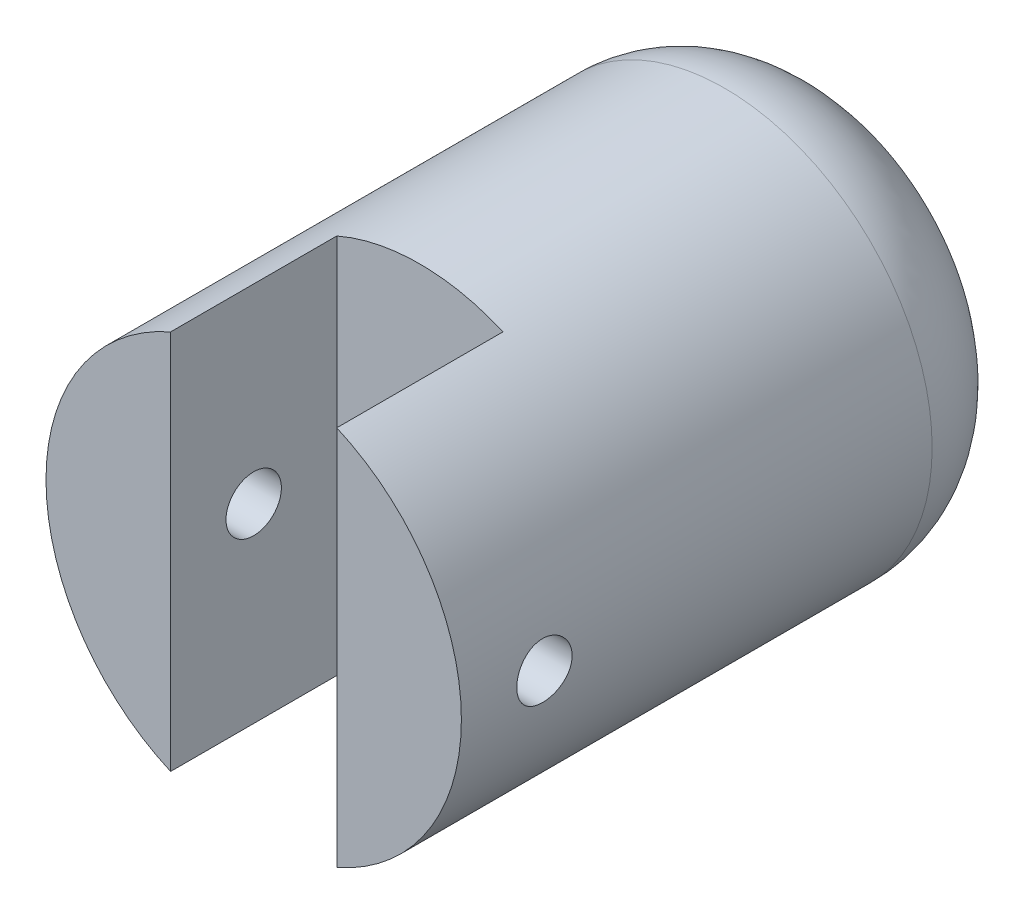
ISO-10303-21;
HEADER;
FILE_DESCRIPTION(('STEP AP214'),'2;1');
FILE_NAME('part.step','',(''),(''),'','','');
FILE_SCHEMA(('AUTOMOTIVE_DESIGN { 1 0 10303 214 1 1 1 1 }'));
ENDSEC;
DATA;
#1=APPLICATION_CONTEXT('core data for automotive mechanical design processes');
#2=APPLICATION_PROTOCOL_DEFINITION('international standard','automotive_design',2000,#1);
#3=PRODUCT_CONTEXT('',#1,'mechanical');
#4=PRODUCT('Part','Part','',(#3));
#5=PRODUCT_RELATED_PRODUCT_CATEGORY('part','',(#4));
#6=PRODUCT_DEFINITION_FORMATION('','',#4);
#7=PRODUCT_DEFINITION_CONTEXT('part definition',#1,'design');
#8=PRODUCT_DEFINITION('design','',#6,#7);
#9=PRODUCT_DEFINITION_SHAPE('','',#8);
#10=(LENGTH_UNIT() NAMED_UNIT(*) SI_UNIT(.MILLI.,.METRE.));
#11=(NAMED_UNIT(*) PLANE_ANGLE_UNIT() SI_UNIT($,.RADIAN.));
#12=(NAMED_UNIT(*) SI_UNIT($,.STERADIAN.) SOLID_ANGLE_UNIT());
#13=UNCERTAINTY_MEASURE_WITH_UNIT(LENGTH_MEASURE(1.E-05),#10,'distance_accuracy_value','');
#14=(GEOMETRIC_REPRESENTATION_CONTEXT(3) GLOBAL_UNCERTAINTY_ASSIGNED_CONTEXT((#13)) GLOBAL_UNIT_ASSIGNED_CONTEXT((#10,
#11,#12)) REPRESENTATION_CONTEXT('',''));
#15=CARTESIAN_POINT('',(0.,0.,0.));
#16=DIRECTION('',(0.,0.,1.));
#17=DIRECTION('',(1.,0.,0.));
#18=AXIS2_PLACEMENT_3D('',#15,#16,#17);
#19=CARTESIAN_POINT('',(0.,0.,21.));
#20=DIRECTION('',(0.,0.,1.));
#21=DIRECTION('',(1.,0.,0.));
#22=AXIS2_PLACEMENT_3D('',#19,#20,#21);
#23=PLANE('',#22);
#24=DIRECTION('',(0.,1.,0.));
#25=VECTOR('',#24,1.);
#26=CARTESIAN_POINT('',(3.,-9.,21.));
#27=LINE('',#26,#25);
#28=CARTESIAN_POINT('',(3.,-6.87386354243376,21.));
#29=VERTEX_POINT('',#28);
#30=CARTESIAN_POINT('',(3.,6.87386354243376,21.));
#31=VERTEX_POINT('',#30);
#32=EDGE_CURVE('E85',#29,#31,#27,.T.);
#33=ORIENTED_EDGE('',*,*,#32,.F.);
#34=CARTESIAN_POINT('',(0.,0.,21.));
#35=DIRECTION('',(0.,0.,1.));
#36=DIRECTION('',(1.,0.,0.));
#37=AXIS2_PLACEMENT_3D('',#34,#35,#36);
#38=CIRCLE('',#37,7.5);
#39=EDGE_CURVE('E98',#29,#31,#38,.T.);
#40=ORIENTED_EDGE('',*,*,#39,.T.);
#41=EDGE_LOOP('',(#33,#40));
#42=FACE_BOUND('',#41,.T.);
#43=ADVANCED_FACE('F36',(#42),#23,.T.);
#44=CARTESIAN_POINT('',(-10.5,0.,18.));
#45=DIRECTION('',(1.,0.,0.));
#46=DIRECTION('',(0.,0.,-1.));
#47=AXIS2_PLACEMENT_3D('',#44,#45,#46);
#48=CYLINDRICAL_SURFACE('',#47,1.);
#49=CARTESIAN_POINT('',(3.,0.,18.));
#50=DIRECTION('',(1.,0.,0.));
#51=DIRECTION('',(0.,0.,-1.));
#52=AXIS2_PLACEMENT_3D('',#49,#50,#51);
#53=CIRCLE('',#52,1.);
#54=CARTESIAN_POINT('',(3.,0.,17.));
#55=VERTEX_POINT('',#54);
#56=EDGE_CURVE('E145',#55,#55,#53,.F.);
#57=ORIENTED_EDGE('',*,*,#56,.T.);
#58=EDGE_LOOP('',(#57));
#59=FACE_BOUND('',#58,.T.);
#60=CARTESIAN_POINT('',(7.5,0.,17.));
#61=CARTESIAN_POINT('',(7.49999917871272,-0.0559044178346422,17.0000023548535));
#62=CARTESIAN_POINT('',(7.49936835363597,-0.11184298963814,17.0047037689812));
#63=CARTESIAN_POINT('',(7.49691255563452,-0.22216136256904,17.0233831745248));
#64=CARTESIAN_POINT('',(7.49508636220862,-0.276539511166519,17.0373706474486));
#65=CARTESIAN_POINT('',(7.49044539924533,-0.382124156313491,17.0742008587707));
#66=CARTESIAN_POINT('',(7.48763132105486,-0.433332841529245,17.0970374055192));
#67=CARTESIAN_POINT('',(7.48132693330196,-0.531181947515148,17.1509034569031));
#68=CARTESIAN_POINT('',(7.47783673279283,-0.577823103168513,17.1819316405832));
#69=CARTESIAN_POINT('',(7.47054497394982,-0.66551291125234,17.2515066308021));
#70=CARTESIAN_POINT('',(7.46674179081055,-0.706528992747931,17.2900943225042));
#71=CARTESIAN_POINT('',(7.45926568778975,-0.781523678365508,17.3736050945383));
#72=CARTESIAN_POINT('',(7.45559277481171,-0.815501909986107,17.4185285099979));
#73=CARTESIAN_POINT('',(7.44877717720095,-0.875579511344539,17.5136495614725));
#74=CARTESIAN_POINT('',(7.44563658882881,-0.901648037412891,17.5638668412393));
#75=CARTESIAN_POINT('',(7.44026293689616,-0.944969225036452,17.6680155336184));
#76=CARTESIAN_POINT('',(7.43802983425604,-0.962222266226391,17.7219467861767));
#77=CARTESIAN_POINT('',(7.43473968284334,-0.987323033860871,17.8316529052508));
#78=CARTESIAN_POINT('',(7.43367572685068,-0.995226021142534,17.8874149172665));
#79=CARTESIAN_POINT('',(7.43282325804657,-1.00157340274059,17.999483089803));
#80=CARTESIAN_POINT('',(7.433034687102,-1.00001822816801,18.0557892254055));
#81=CARTESIAN_POINT('',(7.43470277886495,-0.987538729696174,18.166960565014));
#82=CARTESIAN_POINT('',(7.43615132311171,-0.97667548765881,18.2218327649429));
#83=CARTESIAN_POINT('',(7.44011776387373,-0.945983623171859,18.3289684183801));
#84=CARTESIAN_POINT('',(7.44263568477064,-0.926154796307288,18.3812318123775));
#85=CARTESIAN_POINT('',(7.44846630555513,-0.878029645715957,18.4818548173536));
#86=CARTESIAN_POINT('',(7.45178147061949,-0.849706989568747,18.5302016855972));
#87=CARTESIAN_POINT('',(7.45883118109967,-0.785416966721448,18.6214795409588));
#88=CARTESIAN_POINT('',(7.46256574831765,-0.749449202511926,18.6644102462771));
#89=CARTESIAN_POINT('',(7.47006949616793,-0.670552450131814,18.743991506291));
#90=CARTESIAN_POINT('',(7.47383871770599,-0.627570853513225,18.7805899213512));
#91=CARTESIAN_POINT('',(7.48095961909132,-0.536047085066706,18.8460610224642));
#92=CARTESIAN_POINT('',(7.48431129773577,-0.487504897221186,18.8749336862618));
#93=CARTESIAN_POINT('',(7.49022196871789,-0.386196109865235,18.9241345588474));
#94=CARTESIAN_POINT('',(7.49278063604478,-0.333427789420616,18.9444592655232));
#95=CARTESIAN_POINT('',(7.49681412952036,-0.225185462168125,18.9759446594862));
#96=CARTESIAN_POINT('',(7.49828901344964,-0.169711599771129,18.9871058353197));
#97=CARTESIAN_POINT('',(7.49998120688428,-0.0580834516628229,18.9998792163856));
#98=CARTESIAN_POINT('',(7.50020796924523,-0.00193751727352205,19.0015632008917));
#99=CARTESIAN_POINT('',(7.49940395769259,0.109835808609358,18.9955241679364));
#100=CARTESIAN_POINT('',(7.49837321434299,0.165463212672832,18.9878013791088));
#101=CARTESIAN_POINT('',(7.4951758767905,0.27440685778647,18.963227673308));
#102=CARTESIAN_POINT('',(7.49301357151461,0.327731008256023,18.9464112158389));
#103=CARTESIAN_POINT('',(7.48779504627144,0.430802549396781,18.9041635170315));
#104=CARTESIAN_POINT('',(7.4847387921972,0.48054980350782,18.8787319469934));
#105=CARTESIAN_POINT('',(7.47804918685037,0.57537443930804,18.8198039222084));
#106=CARTESIAN_POINT('',(7.47441257522858,0.620422907198304,18.7862613171433));
#107=CARTESIAN_POINT('',(7.46697864354991,0.70427647349595,18.7121283353879));
#108=CARTESIAN_POINT('',(7.4631813162031,0.743081288311894,18.6715376387418));
#109=CARTESIAN_POINT('',(7.45582451236755,0.813602747115492,18.5841434286802));
#110=CARTESIAN_POINT('',(7.45226674387649,0.845271638044693,18.5373012166309));
#111=CARTESIAN_POINT('',(7.44582066500909,0.900291755394072,18.4389202948595));
#112=CARTESIAN_POINT('',(7.44293233968392,0.923643167551734,18.3873816900448));
#113=CARTESIAN_POINT('',(7.43816405890039,0.961289182503732,18.2812213789862));
#114=CARTESIAN_POINT('',(7.43628117116299,0.975610144233979,18.2266091573946));
#115=CARTESIAN_POINT('',(7.43372874349146,0.994873335719795,18.1157281839356));
#116=CARTESIAN_POINT('',(7.43305913865671,0.99981606713391,18.0594595208378));
#117=CARTESIAN_POINT('',(7.43301115647724,1.00017242903095,17.9473382545732));
#118=CARTESIAN_POINT('',(7.4336226114126,0.995661095972465,17.8914858795179));
#119=CARTESIAN_POINT('',(7.43604591937099,0.977396883433447,17.7813410624481));
#120=CARTESIAN_POINT('',(7.43785777194415,0.963644007416344,17.727048619849));
#121=CARTESIAN_POINT('',(7.44247445136382,0.927311551661038,17.6215781583742));
#122=CARTESIAN_POINT('',(7.445278813297,0.904736104095208,17.5703986944416));
#123=CARTESIAN_POINT('',(7.45156522856411,0.851406713798688,17.472542058087));
#124=CARTESIAN_POINT('',(7.45504729498301,0.820652613152145,17.425864972622));
#125=CARTESIAN_POINT('',(7.46232983591531,0.751562242547543,17.3379551750358));
#126=CARTESIAN_POINT('',(7.46613252877041,0.713170136134506,17.2967665261224));
#127=CARTESIAN_POINT('',(7.47360859500832,0.63001084674912,17.2213883918192));
#128=CARTESIAN_POINT('',(7.47728193784489,0.58524217036489,17.1872005506249));
#129=CARTESIAN_POINT('',(7.48410317568764,0.490376493926413,17.1266664307667));
#130=CARTESIAN_POINT('',(7.48724873213445,0.440257310371984,17.1003546667224));
#131=CARTESIAN_POINT('',(7.49263660329486,0.336296204793666,17.0565597007275));
#132=CARTESIAN_POINT('',(7.49487988462156,0.282458339484946,17.0390670456876));
#133=CARTESIAN_POINT('',(7.49767860871633,0.190294204049209,17.0175259968074));
#134=CARTESIAN_POINT('',(7.49854481817537,0.152545540977889,17.0109633782382));
#135=CARTESIAN_POINT('',(7.49970579245385,0.0765365858080551,17.0021995929173));
#136=CARTESIAN_POINT('',(7.500000562314,0.0382762982256198,16.9999983876932));
#137=CARTESIAN_POINT('',(7.5,0.,17.));
#138=B_SPLINE_CURVE_WITH_KNOTS('',3,(#60,#61,#62,#63,#64,#65,#66,#67,#68,#69,#70,#71,#72,#73,
#74,#75,#76,#77,#78,#79,#80,#81,#82,#83,#84,#85,#86,#87,#88,#89,#90,#91,#92,#93,#94,#95,#96,#97,
#98,#99,#100,#101,#102,#103,#104,#105,#106,#107,#108,#109,#110,#111,#112,#113,#114,#115,#116,
#117,#118,#119,#120,#121,#122,#123,#124,#125,#126,#127,#128,#129,#130,#131,#132,#133,#134,#135,
#136,#137),.UNSPECIFIED.,.T.,.F.,(4,2,2,2,2,2,2,2,2,2,2,2,2,2,2,2,2,2,2,2,2,2,2,2,2,2,2,2,2,2,2,
2,2,2,2,2,2,2,4),(0.,0.167573425652872,0.335318215442523,0.502945846413699,0.670546462820173,
0.839079892217795,1.00762223952418,1.17681360755824,1.34599768883102,1.5141767795718,
1.6823482046246,1.84942442549022,2.01650445587925,2.18410791568949,2.35172009221899,
2.52065272242425,2.68958583926148,2.8585881010127,3.02758135195872,3.19529292496031,
3.3630004217724,3.53007681698232,3.69715958751774,3.86521637384943,4.03328079129381,
4.20243852267726,4.37159247636525,4.54025037367728,4.70889924891818,4.87621463748313,
5.04352996334373,5.21076701851311,5.37800730297952,5.54651833917554,5.71506890625581,
5.88434763337258,6.0534445249621,6.16817869523655,6.2829118534272),.UNSPECIFIED.);
#139=CARTESIAN_POINT('',(7.5,0.,17.));
#140=VERTEX_POINT('',#139);
#141=EDGE_CURVE('E108',#140,#140,#138,.T.);
#142=ORIENTED_EDGE('',*,*,#141,.F.);
#143=EDGE_LOOP('',(#142));
#144=FACE_BOUND('',#143,.T.);
#145=ADVANCED_FACE('F127',(#59,#144),#48,.F.);
#146=CARTESIAN_POINT('',(0.,0.,21.));
#147=DIRECTION('',(0.,0.,-1.));
#148=DIRECTION('',(-1.,0.,0.));
#149=AXIS2_PLACEMENT_3D('',#146,#147,#148);
#150=CYLINDRICAL_SURFACE('',#149,7.5);
#151=CARTESIAN_POINT('',(0.,0.,3.99999999999999));
#152=DIRECTION('',(0.,0.,1.));
#153=DIRECTION('',(1.,0.,0.));
#154=AXIS2_PLACEMENT_3D('',#151,#152,#153);
#155=CIRCLE('',#154,7.5);
#156=CARTESIAN_POINT('',(7.5,0.,3.99999999999999));
#157=VERTEX_POINT('',#156);
#158=EDGE_CURVE('E44',#157,#157,#155,.T.);
#159=ORIENTED_EDGE('',*,*,#158,.T.);
#160=EDGE_LOOP('',(#159));
#161=FACE_BOUND('',#160,.T.);
#162=CARTESIAN_POINT('',(0.,0.,15.));
#163=DIRECTION('',(0.,0.,-1.));
#164=DIRECTION('',(-1.,0.,0.));
#165=AXIS2_PLACEMENT_3D('',#162,#163,#164);
#166=CIRCLE('',#165,7.5);
#167=CARTESIAN_POINT('',(-3.,6.87386354243376,15.));
#168=VERTEX_POINT('',#167);
#169=CARTESIAN_POINT('',(3.,6.87386354243376,15.));
#170=VERTEX_POINT('',#169);
#171=EDGE_CURVE('E100',#168,#170,#166,.T.);
#172=ORIENTED_EDGE('',*,*,#171,.T.);
#173=DIRECTION('',(0.,0.,-1.));
#174=VECTOR('',#173,1.);
#175=CARTESIAN_POINT('',(3.,6.87386354243376,21.));
#176=LINE('',#175,#174);
#177=EDGE_CURVE('E59',#170,#31,#176,.F.);
#178=ORIENTED_EDGE('',*,*,#177,.T.);
#179=ORIENTED_EDGE('',*,*,#39,.F.);
#180=DIRECTION('',(0.,0.,-1.));
#181=VECTOR('',#180,1.);
#182=CARTESIAN_POINT('',(3.,-6.87386354243376,21.));
#183=LINE('',#182,#181);
#184=CARTESIAN_POINT('',(3.,-6.87386354243376,15.));
#185=VERTEX_POINT('',#184);
#186=EDGE_CURVE('E106',#29,#185,#183,.T.);
#187=ORIENTED_EDGE('',*,*,#186,.T.);
#188=CARTESIAN_POINT('',(-3.,-6.87386354243376,15.));
#189=VERTEX_POINT('',#188);
#190=EDGE_CURVE('E94',#185,#189,#166,.T.);
#191=ORIENTED_EDGE('',*,*,#190,.T.);
#192=DIRECTION('',(0.,0.,-1.));
#193=VECTOR('',#192,1.);
#194=CARTESIAN_POINT('',(-3.,-6.87386354243376,21.));
#195=LINE('',#194,#193);
#196=CARTESIAN_POINT('',(-3.,-6.87386354243376,21.));
#197=VERTEX_POINT('',#196);
#198=EDGE_CURVE('E79',#189,#197,#195,.F.);
#199=ORIENTED_EDGE('',*,*,#198,.T.);
#200=CARTESIAN_POINT('',(-3.,6.87386354243376,21.));
#201=VERTEX_POINT('',#200);
#202=EDGE_CURVE('E92',#201,#197,#38,.T.);
#203=ORIENTED_EDGE('',*,*,#202,.F.);
#204=DIRECTION('',(0.,0.,-1.));
#205=VECTOR('',#204,1.);
#206=CARTESIAN_POINT('',(-3.,6.87386354243376,21.));
#207=LINE('',#206,#205);
#208=EDGE_CURVE('E51',#201,#168,#207,.T.);
#209=ORIENTED_EDGE('',*,*,#208,.T.);
#210=EDGE_LOOP('',(#172,#178,#179,#187,#191,#199,#203,#209));
#211=FACE_BOUND('',#210,.T.);
#212=CARTESIAN_POINT('',(-7.5,0.,19.));
#213=CARTESIAN_POINT('',(-7.49999917871272,-0.0559044178346422,18.9999976451466));
#214=CARTESIAN_POINT('',(-7.49936835363597,-0.11184298963814,18.9952962310188));
#215=CARTESIAN_POINT('',(-7.49691255563452,-0.22216136256904,18.9766168254752));
#216=CARTESIAN_POINT('',(-7.49508636220862,-0.276539511166519,18.9626293525514));
#217=CARTESIAN_POINT('',(-7.49044539924533,-0.382124156313492,18.9257991412293));
#218=CARTESIAN_POINT('',(-7.48763132105486,-0.433332841529247,18.9029625944808));
#219=CARTESIAN_POINT('',(-7.48132693330196,-0.53118194751515,18.8490965430969));
#220=CARTESIAN_POINT('',(-7.47783673279283,-0.577823103168513,18.8180683594168));
#221=CARTESIAN_POINT('',(-7.47054497394982,-0.66551291125234,18.7484933691979));
#222=CARTESIAN_POINT('',(-7.46674179081055,-0.706528992747931,18.7099056774958));
#223=CARTESIAN_POINT('',(-7.45926568778975,-0.781523678365508,18.6263949054617));
#224=CARTESIAN_POINT('',(-7.45559277481171,-0.815501909986107,18.5814714900021));
#225=CARTESIAN_POINT('',(-7.44877717720095,-0.875579511344539,18.4863504385275));
#226=CARTESIAN_POINT('',(-7.44563658882881,-0.901648037412891,18.4361331587607));
#227=CARTESIAN_POINT('',(-7.44026293689616,-0.944969225036452,18.3319844663816));
#228=CARTESIAN_POINT('',(-7.43802983425604,-0.962222266226391,18.2780532138234));
#229=CARTESIAN_POINT('',(-7.43473968284334,-0.987323033860871,18.1683470947492));
#230=CARTESIAN_POINT('',(-7.43367572685068,-0.995226021142534,18.1125850827335));
#231=CARTESIAN_POINT('',(-7.43282325804657,-1.00157340274059,18.000516910197));
#232=CARTESIAN_POINT('',(-7.433034687102,-1.00001822816801,17.9442107745946));
#233=CARTESIAN_POINT('',(-7.43470277886495,-0.987538729696174,17.833039434986));
#234=CARTESIAN_POINT('',(-7.43615132311171,-0.97667548765881,17.7781672350572));
#235=CARTESIAN_POINT('',(-7.44011776387373,-0.945983623171859,17.67103158162));
#236=CARTESIAN_POINT('',(-7.44263568477064,-0.926154796307288,17.6187681876225));
#237=CARTESIAN_POINT('',(-7.44846630555513,-0.878029645715957,17.5181451826464));
#238=CARTESIAN_POINT('',(-7.45178147061949,-0.849706989568747,17.4697983144029));
#239=CARTESIAN_POINT('',(-7.45883118109967,-0.785416966721448,17.3785204590412));
#240=CARTESIAN_POINT('',(-7.46256574831765,-0.749449202511926,17.3355897537229));
#241=CARTESIAN_POINT('',(-7.47006949616793,-0.670552450131814,17.2560084937091));
#242=CARTESIAN_POINT('',(-7.47383871770599,-0.627570853513225,17.2194100786488));
#243=CARTESIAN_POINT('',(-7.48095961909132,-0.536047085066706,17.1539389775358));
#244=CARTESIAN_POINT('',(-7.48431129773577,-0.487504897221186,17.1250663137382));
#245=CARTESIAN_POINT('',(-7.49022196871789,-0.386196109865236,17.0758654411526));
#246=CARTESIAN_POINT('',(-7.49278063604478,-0.333427789420616,17.0555407344768));
#247=CARTESIAN_POINT('',(-7.49681412952036,-0.225185462168126,17.0240553405138));
#248=CARTESIAN_POINT('',(-7.49828901344964,-0.169711599771129,17.0128941646803));
#249=CARTESIAN_POINT('',(-7.49998120688428,-0.0580834516628226,17.0001207836144));
#250=CARTESIAN_POINT('',(-7.50020796924523,-0.00193751727352184,16.9984367991083));
#251=CARTESIAN_POINT('',(-7.49940395769259,0.109835808609359,17.0044758320636));
#252=CARTESIAN_POINT('',(-7.49837321434299,0.165463212672832,17.0121986208912));
#253=CARTESIAN_POINT('',(-7.4951758767905,0.27440685778647,17.036772326692));
#254=CARTESIAN_POINT('',(-7.49301357151461,0.327731008256023,17.0535887841611));
#255=CARTESIAN_POINT('',(-7.48779504627144,0.430802549396781,17.0958364829685));
#256=CARTESIAN_POINT('',(-7.4847387921972,0.480549803507819,17.1212680530066));
#257=CARTESIAN_POINT('',(-7.47804918685037,0.575374439308039,17.1801960777917));
#258=CARTESIAN_POINT('',(-7.47441257522858,0.620422907198302,17.2137386828567));
#259=CARTESIAN_POINT('',(-7.46697864354991,0.704276473495949,17.2878716646121));
#260=CARTESIAN_POINT('',(-7.4631813162031,0.743081288311892,17.3284623612582));
#261=CARTESIAN_POINT('',(-7.45582451236755,0.81360274711549,17.4158565713198));
#262=CARTESIAN_POINT('',(-7.45226674387649,0.845271638044692,17.4626987833691));
#263=CARTESIAN_POINT('',(-7.44582066500908,0.900291755394071,17.5610797051405));
#264=CARTESIAN_POINT('',(-7.44293233968392,0.923643167551734,17.6126183099552));
#265=CARTESIAN_POINT('',(-7.43816405890039,0.961289182503733,17.7187786210139));
#266=CARTESIAN_POINT('',(-7.43628117116299,0.975610144233979,17.7733908426054));
#267=CARTESIAN_POINT('',(-7.43372874349146,0.994873335719795,17.8842718160644));
#268=CARTESIAN_POINT('',(-7.43305913865671,0.99981606713391,17.9405404791622));
#269=CARTESIAN_POINT('',(-7.43301115647724,1.00017242903095,18.0526617454268));
#270=CARTESIAN_POINT('',(-7.4336226114126,0.995661095972465,18.1085141204821));
#271=CARTESIAN_POINT('',(-7.43604591937099,0.977396883433448,18.2186589375519));
#272=CARTESIAN_POINT('',(-7.43785777194415,0.963644007416345,18.272951380151));
#273=CARTESIAN_POINT('',(-7.44247445136382,0.927311551661038,18.3784218416258));
#274=CARTESIAN_POINT('',(-7.445278813297,0.904736104095208,18.4296013055584));
#275=CARTESIAN_POINT('',(-7.45156522856411,0.851406713798688,18.527457941913));
#276=CARTESIAN_POINT('',(-7.45504729498301,0.820652613152145,18.574135027378));
#277=CARTESIAN_POINT('',(-7.46232983591531,0.751562242547543,18.6620448249642));
#278=CARTESIAN_POINT('',(-7.46613252877041,0.713170136134506,18.7032334738776));
#279=CARTESIAN_POINT('',(-7.47360859500832,0.630010846749118,18.7786116081808));
#280=CARTESIAN_POINT('',(-7.47728193784489,0.585242170364887,18.8127994493751));
#281=CARTESIAN_POINT('',(-7.48410317568764,0.49037649392641,18.8733335692333));
#282=CARTESIAN_POINT('',(-7.48724873213445,0.440257310371982,18.8996453332776));
#283=CARTESIAN_POINT('',(-7.49263660329486,0.336296204793664,18.9434402992725));
#284=CARTESIAN_POINT('',(-7.49487988462156,0.282458339484944,18.9609329543124));
#285=CARTESIAN_POINT('',(-7.49767860871633,0.190294204049209,18.9824740031926));
#286=CARTESIAN_POINT('',(-7.49854481817537,0.152545540977889,18.9890366217618));
#287=CARTESIAN_POINT('',(-7.49970579245385,0.0765365858080556,18.9978004070827));
#288=CARTESIAN_POINT('',(-7.500000562314,0.03827629822562,19.0000016123068));
#289=CARTESIAN_POINT('',(-7.5,0.,19.));
#290=B_SPLINE_CURVE_WITH_KNOTS('',3,(#212,#213,#214,#215,#216,#217,#218,#219,#220,#221,#222,
#223,#224,#225,#226,#227,#228,#229,#230,#231,#232,#233,#234,#235,#236,#237,#238,#239,#240,#241,
#242,#243,#244,#245,#246,#247,#248,#249,#250,#251,#252,#253,#254,#255,#256,#257,#258,#259,#260,
#261,#262,#263,#264,#265,#266,#267,#268,#269,#270,#271,#272,#273,#274,#275,#276,#277,#278,#279,
#280,#281,#282,#283,#284,#285,#286,#287,#288,#289),.UNSPECIFIED.,.T.,.F.,(4,2,2,2,2,2,2,2,2,2,2,
2,2,2,2,2,2,2,2,2,2,2,2,2,2,2,2,2,2,2,2,2,2,2,2,2,2,2,4),(0.,0.167573425652872,
0.335318215442523,0.502945846413703,0.670546462820173,0.839079892217795,1.00762223952418,
1.17681360755824,1.34599768883102,1.5141767795718,1.6823482046246,1.84942442549022,
2.01650445587925,2.18410791568949,2.35172009221899,2.52065272242425,2.68958583926148,
2.8585881010127,3.02758135195872,3.19529292496031,3.3630004217724,3.53007681698232,
3.69715958751774,3.86521637384942,4.03328079129381,4.20243852267726,4.37159247636525,
4.54025037367728,4.70889924891818,4.87621463748312,5.04352996334373,5.21076701851311,
5.37800730297952,5.54651833917554,5.71506890625581,5.88434763337259,6.0534445249621,
6.16817869523655,6.2829118534272),.UNSPECIFIED.);
#291=CARTESIAN_POINT('',(-7.5,0.,19.));
#292=VERTEX_POINT('',#291);
#293=EDGE_CURVE('E103',#292,#292,#290,.T.);
#294=ORIENTED_EDGE('',*,*,#293,.T.);
#295=EDGE_LOOP('',(#294));
#296=FACE_BOUND('',#295,.T.);
#297=ORIENTED_EDGE('',*,*,#141,.T.);
#298=EDGE_LOOP('',(#297));
#299=FACE_BOUND('',#298,.T.);
#300=ADVANCED_FACE('F90',(#161,#211,#296,#299),#150,.T.);
#301=DIRECTION('',(0.,-1.,0.));
#302=VECTOR('',#301,1.);
#303=CARTESIAN_POINT('',(-3.,-9.,21.));
#304=LINE('',#303,#302);
#305=EDGE_CURVE('E76',#201,#197,#304,.T.);
#306=ORIENTED_EDGE('',*,*,#305,.F.);
#307=ORIENTED_EDGE('',*,*,#202,.T.);
#308=EDGE_LOOP('',(#306,#307));
#309=FACE_BOUND('',#308,.T.);
#310=ADVANCED_FACE('F97',(#309),#23,.T.);
#311=CARTESIAN_POINT('',(0.,0.,0.));
#312=DIRECTION('',(0.,0.,1.));
#313=DIRECTION('',(1.,0.,0.));
#314=AXIS2_PLACEMENT_3D('',#311,#312,#313);
#315=PLANE('',#314);
#316=CARTESIAN_POINT('',(0.,0.,0.));
#317=DIRECTION('',(0.,0.,1.));
#318=DIRECTION('',(1.,0.,0.));
#319=AXIS2_PLACEMENT_3D('',#316,#317,#318);
#320=CIRCLE('',#319,3.5);
#321=CARTESIAN_POINT('',(3.5,0.,0.));
#322=VERTEX_POINT('',#321);
#323=EDGE_CURVE('E11',#322,#322,#320,.F.);
#324=ORIENTED_EDGE('',*,*,#323,.T.);
#325=EDGE_LOOP('',(#324));
#326=FACE_BOUND('',#325,.T.);
#327=ADVANCED_FACE('F125',(#326),#315,.F.);
#328=CARTESIAN_POINT('',(-3.,0.,18.));
#329=DIRECTION('',(-1.,0.,0.));
#330=DIRECTION('',(0.,0.,1.));
#331=AXIS2_PLACEMENT_3D('',#328,#329,#330);
#332=CIRCLE('',#331,1.);
#333=CARTESIAN_POINT('',(-3.,0.,19.));
#334=VERTEX_POINT('',#333);
#335=EDGE_CURVE('E95',#334,#334,#332,.F.);
#336=ORIENTED_EDGE('',*,*,#335,.T.);
#337=EDGE_LOOP('',(#336));
#338=FACE_BOUND('',#337,.T.);
#339=ORIENTED_EDGE('',*,*,#293,.F.);
#340=EDGE_LOOP('',(#339));
#341=FACE_BOUND('',#340,.T.);
#342=ADVANCED_FACE('F119',(#338,#341),#48,.F.);
#343=CARTESIAN_POINT('',(0.,0.,15.));
#344=DIRECTION('',(0.,0.,-1.));
#345=DIRECTION('',(-1.,0.,0.));
#346=AXIS2_PLACEMENT_3D('',#343,#344,#345);
#347=PLANE('',#346);
#348=DIRECTION('',(0.,-1.,0.));
#349=VECTOR('',#348,1.);
#350=CARTESIAN_POINT('',(-3.,-9.,15.));
#351=LINE('',#350,#349);
#352=EDGE_CURVE('E150',#168,#189,#351,.T.);
#353=ORIENTED_EDGE('',*,*,#352,.T.);
#354=ORIENTED_EDGE('',*,*,#190,.F.);
#355=DIRECTION('',(0.,1.,0.));
#356=VECTOR('',#355,1.);
#357=CARTESIAN_POINT('',(3.,-9.,15.));
#358=LINE('',#357,#356);
#359=EDGE_CURVE('E84',#185,#170,#358,.T.);
#360=ORIENTED_EDGE('',*,*,#359,.T.);
#361=ORIENTED_EDGE('',*,*,#171,.F.);
#362=EDGE_LOOP('',(#353,#354,#360,#361));
#363=FACE_BOUND('',#362,.T.);
#364=ADVANCED_FACE('F124',(#363),#347,.F.);
#365=CARTESIAN_POINT('',(3.,-9.,15.));
#366=DIRECTION('',(1.,0.,0.));
#367=DIRECTION('',(0.,0.,-1.));
#368=AXIS2_PLACEMENT_3D('',#365,#366,#367);
#369=PLANE('',#368);
#370=ORIENTED_EDGE('',*,*,#56,.F.);
#371=EDGE_LOOP('',(#370));
#372=FACE_BOUND('',#371,.T.);
#373=ORIENTED_EDGE('',*,*,#32,.T.);
#374=ORIENTED_EDGE('',*,*,#177,.F.);
#375=ORIENTED_EDGE('',*,*,#359,.F.);
#376=ORIENTED_EDGE('',*,*,#186,.F.);
#377=EDGE_LOOP('',(#373,#374,#375,#376));
#378=FACE_BOUND('',#377,.T.);
#379=ADVANCED_FACE('F128',(#372,#378),#369,.F.);
#380=CARTESIAN_POINT('',(-3.,-9.,15.));
#381=DIRECTION('',(-1.,0.,0.));
#382=DIRECTION('',(0.,0.,1.));
#383=AXIS2_PLACEMENT_3D('',#380,#381,#382);
#384=PLANE('',#383);
#385=ORIENTED_EDGE('',*,*,#335,.F.);
#386=EDGE_LOOP('',(#385));
#387=FACE_BOUND('',#386,.T.);
#388=ORIENTED_EDGE('',*,*,#305,.T.);
#389=ORIENTED_EDGE('',*,*,#198,.F.);
#390=ORIENTED_EDGE('',*,*,#352,.F.);
#391=ORIENTED_EDGE('',*,*,#208,.F.);
#392=EDGE_LOOP('',(#388,#389,#390,#391));
#393=FACE_BOUND('',#392,.T.);
#394=ADVANCED_FACE('F78',(#387,#393),#384,.F.);
#395=CARTESIAN_POINT('',(0.,0.,4.));
#396=DIRECTION('',(0.,0.,1.));
#397=DIRECTION('',(1.,0.,0.));
#398=AXIS2_PLACEMENT_3D('',#395,#396,#397);
#399=DEGENERATE_TOROIDAL_SURFACE('',#398,3.5,4.,.T.);
#400=ORIENTED_EDGE('',*,*,#323,.F.);
#401=EDGE_LOOP('',(#400));
#402=FACE_BOUND('',#401,.T.);
#403=ORIENTED_EDGE('',*,*,#158,.F.);
#404=EDGE_LOOP('',(#403));
#405=FACE_BOUND('',#404,.T.);
#406=ADVANCED_FACE('F38',(#402,#405),#399,.T.);
#407=CLOSED_SHELL('',(#43,#145,#300,#310,#327,#342,#364,#379,#394,#406));
#408=MANIFOLD_SOLID_BREP('B2',#407);
#409=ADVANCED_BREP_SHAPE_REPRESENTATION('',(#18,#408),#14);
#410=SHAPE_DEFINITION_REPRESENTATION(#9,#409);
ENDSEC;
END-ISO-10303-21;
